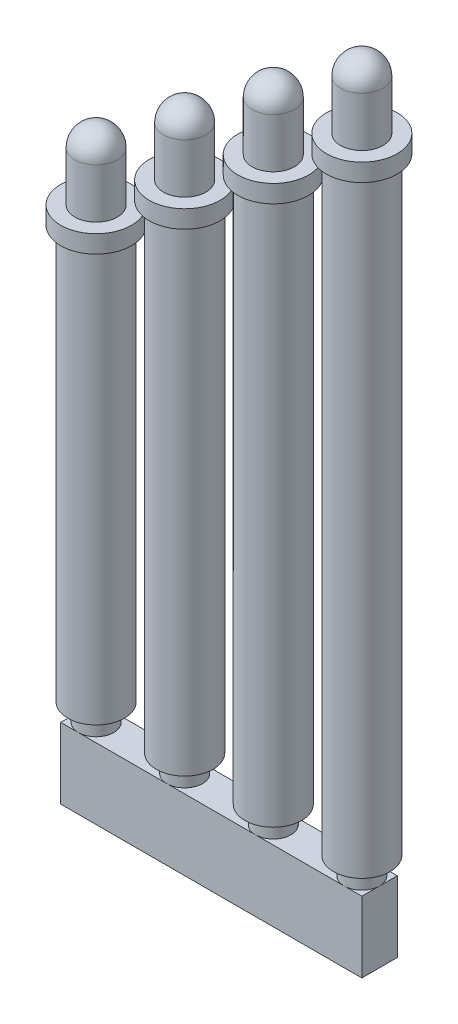
ISO-10303-21;
HEADER;
FILE_DESCRIPTION(('STEP AP214'),'2;1');
FILE_NAME('part.step','',(''),(''),'','','');
FILE_SCHEMA(('AUTOMOTIVE_DESIGN { 1 0 10303 214 1 1 1 1 }'));
ENDSEC;
DATA;
#1=APPLICATION_CONTEXT('core data for automotive mechanical design processes');
#2=APPLICATION_PROTOCOL_DEFINITION('international standard','automotive_design',2000,#1);
#3=PRODUCT_CONTEXT('',#1,'mechanical');
#4=PRODUCT('Part','Part','',(#3));
#5=PRODUCT_RELATED_PRODUCT_CATEGORY('part','',(#4));
#6=PRODUCT_DEFINITION_FORMATION('','',#4);
#7=PRODUCT_DEFINITION_CONTEXT('part definition',#1,'design');
#8=PRODUCT_DEFINITION('design','',#6,#7);
#9=PRODUCT_DEFINITION_SHAPE('','',#8);
#10=(LENGTH_UNIT() NAMED_UNIT(*) SI_UNIT(.MILLI.,.METRE.));
#11=(NAMED_UNIT(*) PLANE_ANGLE_UNIT() SI_UNIT($,.RADIAN.));
#12=(NAMED_UNIT(*) SI_UNIT($,.STERADIAN.) SOLID_ANGLE_UNIT());
#13=UNCERTAINTY_MEASURE_WITH_UNIT(LENGTH_MEASURE(1.E-05),#10,'distance_accuracy_value','');
#14=(GEOMETRIC_REPRESENTATION_CONTEXT(3) GLOBAL_UNCERTAINTY_ASSIGNED_CONTEXT((#13)) GLOBAL_UNIT_ASSIGNED_CONTEXT((#10,
#11,#12)) REPRESENTATION_CONTEXT('',''));
#15=CARTESIAN_POINT('',(0.,0.,0.));
#16=DIRECTION('',(0.,0.,1.));
#17=DIRECTION('',(1.,0.,0.));
#18=AXIS2_PLACEMENT_3D('',#15,#16,#17);
#19=CARTESIAN_POINT('',(0.,0.,0.));
#20=DIRECTION('',(0.,-1.,0.));
#21=DIRECTION('',(0.,0.,-1.));
#22=AXIS2_PLACEMENT_3D('',#19,#20,#21);
#23=PLANE('',#22);
#24=DIRECTION('',(1.,0.,0.));
#25=VECTOR('',#24,1.);
#26=CARTESIAN_POINT('',(-0.499999999999999,0.,-0.499999999999999));
#27=LINE('',#26,#25);
#28=CARTESIAN_POINT('',(7.5,0.,-0.499999999999999));
#29=VERTEX_POINT('',#28);
#30=CARTESIAN_POINT('',(8.,0.,-0.499999999999999));
#31=VERTEX_POINT('',#30);
#32=EDGE_CURVE('E154',#29,#31,#27,.T.);
#33=ORIENTED_EDGE('',*,*,#32,.F.);
#34=CARTESIAN_POINT('',(7.5,0.,0.));
#35=DIRECTION('',(0.,1.,0.));
#36=DIRECTION('',(-1.,0.,0.));
#37=AXIS2_PLACEMENT_3D('',#34,#35,#36);
#38=CIRCLE('',#37,0.5);
#39=CARTESIAN_POINT('',(8.,0.,0.));
#40=VERTEX_POINT('',#39);
#41=EDGE_CURVE('E49',#40,#29,#38,.T.);
#42=ORIENTED_EDGE('',*,*,#41,.F.);
#43=DIRECTION('',(0.,0.,1.));
#44=VECTOR('',#43,1.);
#45=CARTESIAN_POINT('',(8.,0.,0.499999999999999));
#46=LINE('',#45,#44);
#47=EDGE_CURVE('E142',#31,#40,#46,.T.);
#48=ORIENTED_EDGE('',*,*,#47,.F.);
#49=EDGE_LOOP('',(#33,#42,#48));
#50=FACE_BOUND('',#49,.T.);
#51=ADVANCED_FACE('F34',(#50),#23,.F.);
#52=CARTESIAN_POINT('',(8.,0.,0.499999999999999));
#53=VERTEX_POINT('',#52);
#54=EDGE_CURVE('E120',#40,#53,#46,.T.);
#55=ORIENTED_EDGE('',*,*,#54,.F.);
#56=CARTESIAN_POINT('',(7.5,0.,0.499999999999999));
#57=VERTEX_POINT('',#56);
#58=EDGE_CURVE('E107',#57,#40,#38,.T.);
#59=ORIENTED_EDGE('',*,*,#58,.F.);
#60=DIRECTION('',(-1.,0.,0.));
#61=VECTOR('',#60,1.);
#62=CARTESIAN_POINT('',(-0.499999999999999,0.,0.499999999999999));
#63=LINE('',#62,#61);
#64=EDGE_CURVE('E119',#53,#57,#63,.T.);
#65=ORIENTED_EDGE('',*,*,#64,.F.);
#66=EDGE_LOOP('',(#55,#59,#65));
#67=FACE_BOUND('',#66,.T.);
#68=ADVANCED_FACE('F117',(#67),#23,.F.);
#69=CARTESIAN_POINT('',(5.,0.,0.499999999999999));
#70=VERTEX_POINT('',#69);
#71=EDGE_CURVE('E123',#57,#70,#63,.T.);
#72=ORIENTED_EDGE('',*,*,#71,.F.);
#73=EDGE_CURVE('E103',#29,#57,#38,.T.);
#74=ORIENTED_EDGE('',*,*,#73,.F.);
#75=CARTESIAN_POINT('',(5.,0.,-0.499999999999999));
#76=VERTEX_POINT('',#75);
#77=EDGE_CURVE('E299',#76,#29,#27,.T.);
#78=ORIENTED_EDGE('',*,*,#77,.F.);
#79=CARTESIAN_POINT('',(5.,0.,0.));
#80=DIRECTION('',(0.,1.,0.));
#81=DIRECTION('',(-1.,0.,0.));
#82=AXIS2_PLACEMENT_3D('',#79,#80,#81);
#83=CIRCLE('',#82,0.5);
#84=EDGE_CURVE('E56',#70,#76,#83,.T.);
#85=ORIENTED_EDGE('',*,*,#84,.F.);
#86=EDGE_LOOP('',(#72,#74,#78,#85));
#87=FACE_BOUND('',#86,.T.);
#88=ADVANCED_FACE('F124',(#87),#23,.F.);
#89=CARTESIAN_POINT('',(2.5,0.,0.499999999999999));
#90=VERTEX_POINT('',#89);
#91=EDGE_CURVE('E127',#70,#90,#63,.T.);
#92=ORIENTED_EDGE('',*,*,#91,.F.);
#93=EDGE_CURVE('E192',#76,#70,#83,.T.);
#94=ORIENTED_EDGE('',*,*,#93,.F.);
#95=CARTESIAN_POINT('',(2.5,0.,-0.499999999999999));
#96=VERTEX_POINT('',#95);
#97=EDGE_CURVE('E295',#96,#76,#27,.T.);
#98=ORIENTED_EDGE('',*,*,#97,.F.);
#99=CARTESIAN_POINT('',(2.5,0.,0.));
#100=DIRECTION('',(0.,1.,0.));
#101=DIRECTION('',(-1.,0.,0.));
#102=AXIS2_PLACEMENT_3D('',#99,#100,#101);
#103=CIRCLE('',#102,0.5);
#104=EDGE_CURVE('E167',#90,#96,#103,.T.);
#105=ORIENTED_EDGE('',*,*,#104,.F.);
#106=EDGE_LOOP('',(#92,#94,#98,#105));
#107=FACE_BOUND('',#106,.T.);
#108=ADVANCED_FACE('F282',(#107),#23,.F.);
#109=CARTESIAN_POINT('',(0.,14.65,0.));
#110=DIRECTION('',(0.,1.,0.));
#111=DIRECTION('',(-1.,0.,0.));
#112=AXIS2_PLACEMENT_3D('',#109,#110,#111);
#113=CYLINDRICAL_SURFACE('',#112,0.499999999999999);
#114=CARTESIAN_POINT('',(0.,0.,0.));
#115=DIRECTION('',(0.,1.,0.));
#116=DIRECTION('',(-1.,0.,0.));
#117=AXIS2_PLACEMENT_3D('',#114,#115,#116);
#118=CIRCLE('',#117,0.499999999999999);
#119=CARTESIAN_POINT('',(-0.499999999999999,0.,0.));
#120=VERTEX_POINT('',#119);
#121=CARTESIAN_POINT('',(0.,0.,0.499999999999999));
#122=VERTEX_POINT('',#121);
#123=EDGE_CURVE('E42',#120,#122,#118,.T.);
#124=ORIENTED_EDGE('',*,*,#123,.T.);
#125=CARTESIAN_POINT('',(0.,0.,-0.499999999999999));
#126=VERTEX_POINT('',#125);
#127=EDGE_CURVE('E290',#122,#126,#118,.T.);
#128=ORIENTED_EDGE('',*,*,#127,.T.);
#129=EDGE_CURVE('E310',#126,#120,#118,.T.);
#130=ORIENTED_EDGE('',*,*,#129,.T.);
#131=EDGE_LOOP('',(#124,#128,#130));
#132=FACE_BOUND('',#131,.T.);
#133=CARTESIAN_POINT('',(0.,0.5,0.));
#134=DIRECTION('',(0.,1.,0.));
#135=DIRECTION('',(-1.,0.,0.));
#136=AXIS2_PLACEMENT_3D('',#133,#134,#135);
#137=CIRCLE('',#136,0.499999999999999);
#138=CARTESIAN_POINT('',(-0.499999999999999,0.5,0.));
#139=VERTEX_POINT('',#138);
#140=EDGE_CURVE('E312',#139,#139,#137,.T.);
#141=ORIENTED_EDGE('',*,*,#140,.F.);
#142=EDGE_LOOP('',(#141));
#143=FACE_BOUND('',#142,.T.);
#144=ADVANCED_FACE('F308',(#132,#143),#113,.T.);
#145=CARTESIAN_POINT('',(-0.499999999999999,0.5,0.));
#146=DIRECTION('',(0.,-1.,0.));
#147=DIRECTION('',(1.,0.,0.));
#148=AXIS2_PLACEMENT_3D('',#145,#146,#147);
#149=PLANE('',#148);
#150=ORIENTED_EDGE('',*,*,#140,.T.);
#151=EDGE_LOOP('',(#150));
#152=FACE_BOUND('',#151,.T.);
#153=CARTESIAN_POINT('',(0.,0.5,0.));
#154=DIRECTION('',(0.,1.,0.));
#155=DIRECTION('',(-1.,0.,0.));
#156=AXIS2_PLACEMENT_3D('',#153,#154,#155);
#157=CIRCLE('',#156,0.799999999999999);
#158=CARTESIAN_POINT('',(-0.799999999999999,0.5,0.));
#159=VERTEX_POINT('',#158);
#160=EDGE_CURVE('E316',#159,#159,#157,.T.);
#161=ORIENTED_EDGE('',*,*,#160,.F.);
#162=EDGE_LOOP('',(#161));
#163=FACE_BOUND('',#162,.T.);
#164=ADVANCED_FACE('F366',(#152,#163),#149,.T.);
#165=CARTESIAN_POINT('',(0.,14.65,0.));
#166=DIRECTION('',(0.,1.,0.));
#167=DIRECTION('',(-1.,0.,0.));
#168=AXIS2_PLACEMENT_3D('',#165,#166,#167);
#169=CYLINDRICAL_SURFACE('',#168,0.799999999999999);
#170=ORIENTED_EDGE('',*,*,#160,.T.);
#171=EDGE_LOOP('',(#170));
#172=FACE_BOUND('',#171,.T.);
#173=CARTESIAN_POINT('',(0.,12.15,0.));
#174=DIRECTION('',(0.,1.,0.));
#175=DIRECTION('',(-1.,0.,0.));
#176=AXIS2_PLACEMENT_3D('',#173,#174,#175);
#177=CIRCLE('',#176,0.8);
#178=CARTESIAN_POINT('',(-0.8,12.15,0.));
#179=VERTEX_POINT('',#178);
#180=EDGE_CURVE('E319',#179,#179,#177,.T.);
#181=ORIENTED_EDGE('',*,*,#180,.F.);
#182=EDGE_LOOP('',(#181));
#183=FACE_BOUND('',#182,.T.);
#184=ADVANCED_FACE('F362',(#172,#183),#169,.T.);
#185=CARTESIAN_POINT('',(-1.,12.15,0.));
#186=DIRECTION('',(0.,-1.,0.));
#187=DIRECTION('',(1.,0.,0.));
#188=AXIS2_PLACEMENT_3D('',#185,#186,#187);
#189=PLANE('',#188);
#190=ORIENTED_EDGE('',*,*,#180,.T.);
#191=EDGE_LOOP('',(#190));
#192=FACE_BOUND('',#191,.T.);
#193=CARTESIAN_POINT('',(0.,12.15,0.));
#194=DIRECTION('',(0.,1.,0.));
#195=DIRECTION('',(-1.,0.,0.));
#196=AXIS2_PLACEMENT_3D('',#193,#194,#195);
#197=CIRCLE('',#196,0.999999999999999);
#198=CARTESIAN_POINT('',(-1.,12.15,0.));
#199=VERTEX_POINT('',#198);
#200=EDGE_CURVE('E322',#199,#199,#197,.T.);
#201=ORIENTED_EDGE('',*,*,#200,.F.);
#202=EDGE_LOOP('',(#201));
#203=FACE_BOUND('',#202,.T.);
#204=ADVANCED_FACE('F358',(#192,#203),#189,.T.);
#205=CARTESIAN_POINT('',(0.,14.65,0.));
#206=DIRECTION('',(0.,1.,0.));
#207=DIRECTION('',(-1.,0.,0.));
#208=AXIS2_PLACEMENT_3D('',#205,#206,#207);
#209=CYLINDRICAL_SURFACE('',#208,0.999999999999999);
#210=ORIENTED_EDGE('',*,*,#200,.T.);
#211=EDGE_LOOP('',(#210));
#212=FACE_BOUND('',#211,.T.);
#213=CARTESIAN_POINT('',(0.,12.65,0.));
#214=DIRECTION('',(0.,1.,0.));
#215=DIRECTION('',(-1.,0.,0.));
#216=AXIS2_PLACEMENT_3D('',#213,#214,#215);
#217=CIRCLE('',#216,0.999999999999999);
#218=CARTESIAN_POINT('',(-1.,12.65,0.));
#219=VERTEX_POINT('',#218);
#220=EDGE_CURVE('E325',#219,#219,#217,.T.);
#221=ORIENTED_EDGE('',*,*,#220,.F.);
#222=EDGE_LOOP('',(#221));
#223=FACE_BOUND('',#222,.T.);
#224=ADVANCED_FACE('F354',(#212,#223),#209,.T.);
#225=CARTESIAN_POINT('',(-1.,12.65,0.));
#226=DIRECTION('',(0.,1.,0.));
#227=DIRECTION('',(-1.,0.,0.));
#228=AXIS2_PLACEMENT_3D('',#225,#226,#227);
#229=PLANE('',#228);
#230=ORIENTED_EDGE('',*,*,#220,.T.);
#231=EDGE_LOOP('',(#230));
#232=FACE_BOUND('',#231,.T.);
#233=CARTESIAN_POINT('',(0.,12.65,0.));
#234=DIRECTION('',(0.,1.,0.));
#235=DIRECTION('',(-1.,0.,0.));
#236=AXIS2_PLACEMENT_3D('',#233,#234,#235);
#237=CIRCLE('',#236,0.599999999999999);
#238=CARTESIAN_POINT('',(-0.6,12.65,0.));
#239=VERTEX_POINT('',#238);
#240=EDGE_CURVE('E328',#239,#239,#237,.T.);
#241=ORIENTED_EDGE('',*,*,#240,.F.);
#242=EDGE_LOOP('',(#241));
#243=FACE_BOUND('',#242,.T.);
#244=ADVANCED_FACE('F350',(#232,#243),#229,.T.);
#245=CARTESIAN_POINT('',(0.,14.65,0.));
#246=DIRECTION('',(0.,1.,0.));
#247=DIRECTION('',(-1.,0.,0.));
#248=AXIS2_PLACEMENT_3D('',#245,#246,#247);
#249=CYLINDRICAL_SURFACE('',#248,0.599999999999999);
#250=CARTESIAN_POINT('',(0.,14.05,0.));
#251=DIRECTION('',(0.,1.,0.));
#252=DIRECTION('',(-1.,0.,0.));
#253=AXIS2_PLACEMENT_3D('',#250,#251,#252);
#254=CIRCLE('',#253,0.599999999999999);
#255=CARTESIAN_POINT('',(-0.6,14.05,0.));
#256=VERTEX_POINT('',#255);
#257=EDGE_CURVE('E11',#256,#256,#254,.F.);
#258=ORIENTED_EDGE('',*,*,#257,.T.);
#259=EDGE_LOOP('',(#258));
#260=FACE_BOUND('',#259,.T.);
#261=ORIENTED_EDGE('',*,*,#240,.T.);
#262=EDGE_LOOP('',(#261));
#263=FACE_BOUND('',#262,.T.);
#264=ADVANCED_FACE('F347',(#260,#263),#249,.T.);
#265=CARTESIAN_POINT('',(0.,14.05,0.));
#266=DIRECTION('',(0.,1.,0.));
#267=DIRECTION('',(-1.,0.,0.));
#268=AXIS2_PLACEMENT_3D('',#265,#266,#267);
#269=SPHERICAL_SURFACE('',#268,0.6);
#270=ORIENTED_EDGE('',*,*,#257,.F.);
#271=EDGE_LOOP('',(#270));
#272=FACE_BOUND('',#271,.T.);
#273=ADVANCED_FACE('F36',(#272),#269,.T.);
#274=ORIENTED_EDGE('',*,*,#123,.F.);
#275=DIRECTION('',(0.,0.,-1.));
#276=VECTOR('',#275,1.);
#277=CARTESIAN_POINT('',(-0.499999999999999,0.,0.499999999999999));
#278=LINE('',#277,#276);
#279=CARTESIAN_POINT('',(-0.499999999999999,0.,0.499999999999999));
#280=VERTEX_POINT('',#279);
#281=EDGE_CURVE('E155',#280,#120,#278,.T.);
#282=ORIENTED_EDGE('',*,*,#281,.F.);
#283=EDGE_CURVE('E135',#122,#280,#63,.T.);
#284=ORIENTED_EDGE('',*,*,#283,.F.);
#285=EDGE_LOOP('',(#274,#282,#284));
#286=FACE_BOUND('',#285,.T.);
#287=ADVANCED_FACE('F272',(#286),#23,.F.);
#288=EDGE_CURVE('E141',#90,#122,#63,.T.);
#289=ORIENTED_EDGE('',*,*,#288,.F.);
#290=EDGE_CURVE('E169',#96,#90,#103,.T.);
#291=ORIENTED_EDGE('',*,*,#290,.F.);
#292=EDGE_CURVE('E153',#126,#96,#27,.T.);
#293=ORIENTED_EDGE('',*,*,#292,.F.);
#294=ORIENTED_EDGE('',*,*,#127,.F.);
#295=EDGE_LOOP('',(#289,#291,#293,#294));
#296=FACE_BOUND('',#295,.T.);
#297=ADVANCED_FACE('F261',(#296),#23,.F.);
#298=CARTESIAN_POINT('',(-0.499999999999999,-2.,0.499999999999999));
#299=DIRECTION('',(1.,0.,0.));
#300=DIRECTION('',(0.,0.,-1.));
#301=AXIS2_PLACEMENT_3D('',#298,#299,#300);
#302=PLANE('',#301);
#303=ORIENTED_EDGE('',*,*,#281,.T.);
#304=CARTESIAN_POINT('',(-0.499999999999999,0.,-0.499999999999999));
#305=VERTEX_POINT('',#304);
#306=EDGE_CURVE('E157',#120,#305,#278,.T.);
#307=ORIENTED_EDGE('',*,*,#306,.T.);
#308=DIRECTION('',(0.,1.,0.));
#309=VECTOR('',#308,1.);
#310=CARTESIAN_POINT('',(-0.499999999999999,-2.,-0.499999999999999));
#311=LINE('',#310,#309);
#312=CARTESIAN_POINT('',(-0.499999999999999,-2.,-0.499999999999999));
#313=VERTEX_POINT('',#312);
#314=EDGE_CURVE('E303',#313,#305,#311,.T.);
#315=ORIENTED_EDGE('',*,*,#314,.F.);
#316=DIRECTION('',(0.,0.,-1.));
#317=VECTOR('',#316,1.);
#318=CARTESIAN_POINT('',(-0.499999999999999,-2.,0.499999999999999));
#319=LINE('',#318,#317);
#320=CARTESIAN_POINT('',(-0.499999999999999,-2.,0.499999999999999));
#321=VERTEX_POINT('',#320);
#322=EDGE_CURVE('E134',#321,#313,#319,.T.);
#323=ORIENTED_EDGE('',*,*,#322,.F.);
#324=DIRECTION('',(0.,1.,0.));
#325=VECTOR('',#324,1.);
#326=CARTESIAN_POINT('',(-0.499999999999999,-2.,0.499999999999999));
#327=LINE('',#326,#325);
#328=EDGE_CURVE('E160',#321,#280,#327,.T.);
#329=ORIENTED_EDGE('',*,*,#328,.T.);
#330=EDGE_LOOP('',(#303,#307,#315,#323,#329));
#331=FACE_BOUND('',#330,.T.);
#332=ADVANCED_FACE('F271',(#331),#302,.F.);
#333=CARTESIAN_POINT('',(-0.499999999999999,-2.,-0.499999999999999));
#334=DIRECTION('',(0.,0.,1.));
#335=DIRECTION('',(1.,0.,0.));
#336=AXIS2_PLACEMENT_3D('',#333,#334,#335);
#337=PLANE('',#336);
#338=EDGE_CURVE('E149',#305,#126,#27,.T.);
#339=ORIENTED_EDGE('',*,*,#338,.T.);
#340=ORIENTED_EDGE('',*,*,#292,.T.);
#341=ORIENTED_EDGE('',*,*,#97,.T.);
#342=ORIENTED_EDGE('',*,*,#77,.T.);
#343=ORIENTED_EDGE('',*,*,#32,.T.);
#344=DIRECTION('',(0.,1.,0.));
#345=VECTOR('',#344,1.);
#346=CARTESIAN_POINT('',(8.,-2.,-0.499999999999999));
#347=LINE('',#346,#345);
#348=CARTESIAN_POINT('',(8.,-2.,-0.499999999999999));
#349=VERTEX_POINT('',#348);
#350=EDGE_CURVE('E332',#349,#31,#347,.T.);
#351=ORIENTED_EDGE('',*,*,#350,.F.);
#352=DIRECTION('',(1.,0.,0.));
#353=VECTOR('',#352,1.);
#354=CARTESIAN_POINT('',(-0.499999999999999,-2.,-0.499999999999999));
#355=LINE('',#354,#353);
#356=EDGE_CURVE('E137',#313,#349,#355,.T.);
#357=ORIENTED_EDGE('',*,*,#356,.F.);
#358=ORIENTED_EDGE('',*,*,#314,.T.);
#359=EDGE_LOOP('',(#339,#340,#341,#342,#343,#351,#357,#358));
#360=FACE_BOUND('',#359,.T.);
#361=ADVANCED_FACE('F278',(#360),#337,.F.);
#362=CARTESIAN_POINT('',(8.,-2.,0.499999999999999));
#363=DIRECTION('',(-1.,0.,0.));
#364=DIRECTION('',(0.,0.,1.));
#365=AXIS2_PLACEMENT_3D('',#362,#363,#364);
#366=PLANE('',#365);
#367=ORIENTED_EDGE('',*,*,#47,.T.);
#368=ORIENTED_EDGE('',*,*,#54,.T.);
#369=DIRECTION('',(0.,1.,0.));
#370=VECTOR('',#369,1.);
#371=CARTESIAN_POINT('',(8.,-2.,0.499999999999999));
#372=LINE('',#371,#370);
#373=CARTESIAN_POINT('',(8.,-2.,0.499999999999999));
#374=VERTEX_POINT('',#373);
#375=EDGE_CURVE('E133',#374,#53,#372,.T.);
#376=ORIENTED_EDGE('',*,*,#375,.F.);
#377=DIRECTION('',(0.,0.,1.));
#378=VECTOR('',#377,1.);
#379=CARTESIAN_POINT('',(8.,-2.,0.499999999999999));
#380=LINE('',#379,#378);
#381=EDGE_CURVE('E161',#349,#374,#380,.T.);
#382=ORIENTED_EDGE('',*,*,#381,.F.);
#383=ORIENTED_EDGE('',*,*,#350,.T.);
#384=EDGE_LOOP('',(#367,#368,#376,#382,#383));
#385=FACE_BOUND('',#384,.T.);
#386=ADVANCED_FACE('F338',(#385),#366,.F.);
#387=CARTESIAN_POINT('',(-0.499999999999999,-2.,0.499999999999999));
#388=DIRECTION('',(0.,0.,-1.));
#389=DIRECTION('',(-1.,0.,0.));
#390=AXIS2_PLACEMENT_3D('',#387,#388,#389);
#391=PLANE('',#390);
#392=ORIENTED_EDGE('',*,*,#64,.T.);
#393=ORIENTED_EDGE('',*,*,#71,.T.);
#394=ORIENTED_EDGE('',*,*,#91,.T.);
#395=ORIENTED_EDGE('',*,*,#288,.T.);
#396=ORIENTED_EDGE('',*,*,#283,.T.);
#397=ORIENTED_EDGE('',*,*,#328,.F.);
#398=DIRECTION('',(-1.,0.,0.));
#399=VECTOR('',#398,1.);
#400=CARTESIAN_POINT('',(-0.499999999999999,-2.,0.499999999999999));
#401=LINE('',#400,#399);
#402=EDGE_CURVE('E158',#374,#321,#401,.T.);
#403=ORIENTED_EDGE('',*,*,#402,.F.);
#404=ORIENTED_EDGE('',*,*,#375,.T.);
#405=EDGE_LOOP('',(#392,#393,#394,#395,#396,#397,#403,#404));
#406=FACE_BOUND('',#405,.T.);
#407=ADVANCED_FACE('F130',(#406),#391,.F.);
#408=CARTESIAN_POINT('',(0.,-2.,0.));
#409=DIRECTION('',(0.,-1.,0.));
#410=DIRECTION('',(0.,0.,-1.));
#411=AXIS2_PLACEMENT_3D('',#408,#409,#410);
#412=PLANE('',#411);
#413=ORIENTED_EDGE('',*,*,#322,.T.);
#414=ORIENTED_EDGE('',*,*,#356,.T.);
#415=ORIENTED_EDGE('',*,*,#381,.T.);
#416=ORIENTED_EDGE('',*,*,#402,.T.);
#417=EDGE_LOOP('',(#413,#414,#415,#416));
#418=FACE_BOUND('',#417,.T.);
#419=ADVANCED_FACE('F259',(#418),#412,.T.);
#420=ORIENTED_EDGE('',*,*,#129,.F.);
#421=ORIENTED_EDGE('',*,*,#338,.F.);
#422=ORIENTED_EDGE('',*,*,#306,.F.);
#423=EDGE_LOOP('',(#420,#421,#422));
#424=FACE_BOUND('',#423,.T.);
#425=ADVANCED_FACE('F251',(#424),#23,.F.);
#426=CARTESIAN_POINT('',(2.5,16.51,0.));
#427=DIRECTION('',(0.,1.,0.));
#428=DIRECTION('',(-1.,0.,0.));
#429=AXIS2_PLACEMENT_3D('',#426,#427,#428);
#430=CYLINDRICAL_SURFACE('',#429,0.5);
#431=ORIENTED_EDGE('',*,*,#104,.T.);
#432=ORIENTED_EDGE('',*,*,#290,.T.);
#433=EDGE_LOOP('',(#431,#432));
#434=FACE_BOUND('',#433,.T.);
#435=CARTESIAN_POINT('',(2.5,0.5,0.));
#436=DIRECTION('',(0.,1.,0.));
#437=DIRECTION('',(-1.,0.,0.));
#438=AXIS2_PLACEMENT_3D('',#435,#436,#437);
#439=CIRCLE('',#438,0.5);
#440=CARTESIAN_POINT('',(2.,0.5,0.));
#441=VERTEX_POINT('',#440);
#442=EDGE_CURVE('E170',#441,#441,#439,.T.);
#443=ORIENTED_EDGE('',*,*,#442,.F.);
#444=EDGE_LOOP('',(#443));
#445=FACE_BOUND('',#444,.T.);
#446=ADVANCED_FACE('F258',(#434,#445),#430,.T.);
#447=CARTESIAN_POINT('',(2.,0.5,0.));
#448=DIRECTION('',(0.,-1.,0.));
#449=DIRECTION('',(1.,0.,0.));
#450=AXIS2_PLACEMENT_3D('',#447,#448,#449);
#451=PLANE('',#450);
#452=ORIENTED_EDGE('',*,*,#442,.T.);
#453=EDGE_LOOP('',(#452));
#454=FACE_BOUND('',#453,.T.);
#455=CARTESIAN_POINT('',(2.5,0.5,0.));
#456=DIRECTION('',(0.,1.,0.));
#457=DIRECTION('',(-1.,0.,0.));
#458=AXIS2_PLACEMENT_3D('',#455,#456,#457);
#459=CIRCLE('',#458,0.8);
#460=CARTESIAN_POINT('',(1.7,0.5,0.));
#461=VERTEX_POINT('',#460);
#462=EDGE_CURVE('E173',#461,#461,#459,.T.);
#463=ORIENTED_EDGE('',*,*,#462,.F.);
#464=EDGE_LOOP('',(#463));
#465=FACE_BOUND('',#464,.T.);
#466=ADVANCED_FACE('F266',(#454,#465),#451,.T.);
#467=CARTESIAN_POINT('',(2.5,16.51,0.));
#468=DIRECTION('',(0.,1.,0.));
#469=DIRECTION('',(-1.,0.,0.));
#470=AXIS2_PLACEMENT_3D('',#467,#468,#469);
#471=CYLINDRICAL_SURFACE('',#470,0.8);
#472=ORIENTED_EDGE('',*,*,#462,.T.);
#473=EDGE_LOOP('',(#472));
#474=FACE_BOUND('',#473,.T.);
#475=CARTESIAN_POINT('',(2.5,14.01,0.));
#476=DIRECTION('',(0.,1.,0.));
#477=DIRECTION('',(-1.,0.,0.));
#478=AXIS2_PLACEMENT_3D('',#475,#476,#477);
#479=CIRCLE('',#478,0.8);
#480=CARTESIAN_POINT('',(1.7,14.01,0.));
#481=VERTEX_POINT('',#480);
#482=EDGE_CURVE('E176',#481,#481,#479,.T.);
#483=ORIENTED_EDGE('',*,*,#482,.F.);
#484=EDGE_LOOP('',(#483));
#485=FACE_BOUND('',#484,.T.);
#486=ADVANCED_FACE('F495',(#474,#485),#471,.T.);
#487=CARTESIAN_POINT('',(1.5,14.01,0.));
#488=DIRECTION('',(0.,-1.,0.));
#489=DIRECTION('',(1.,0.,0.));
#490=AXIS2_PLACEMENT_3D('',#487,#488,#489);
#491=PLANE('',#490);
#492=ORIENTED_EDGE('',*,*,#482,.T.);
#493=EDGE_LOOP('',(#492));
#494=FACE_BOUND('',#493,.T.);
#495=CARTESIAN_POINT('',(2.5,14.01,0.));
#496=DIRECTION('',(0.,1.,0.));
#497=DIRECTION('',(-1.,0.,0.));
#498=AXIS2_PLACEMENT_3D('',#495,#496,#497);
#499=CIRCLE('',#498,1.);
#500=CARTESIAN_POINT('',(1.5,14.01,0.));
#501=VERTEX_POINT('',#500);
#502=EDGE_CURVE('E179',#501,#501,#499,.T.);
#503=ORIENTED_EDGE('',*,*,#502,.F.);
#504=EDGE_LOOP('',(#503));
#505=FACE_BOUND('',#504,.T.);
#506=ADVANCED_FACE('F505',(#494,#505),#491,.T.);
#507=CARTESIAN_POINT('',(2.5,16.51,0.));
#508=DIRECTION('',(0.,1.,0.));
#509=DIRECTION('',(-1.,0.,0.));
#510=AXIS2_PLACEMENT_3D('',#507,#508,#509);
#511=CYLINDRICAL_SURFACE('',#510,1.);
#512=ORIENTED_EDGE('',*,*,#502,.T.);
#513=EDGE_LOOP('',(#512));
#514=FACE_BOUND('',#513,.T.);
#515=CARTESIAN_POINT('',(2.5,14.51,0.));
#516=DIRECTION('',(0.,1.,0.));
#517=DIRECTION('',(-1.,0.,0.));
#518=AXIS2_PLACEMENT_3D('',#515,#516,#517);
#519=CIRCLE('',#518,1.);
#520=CARTESIAN_POINT('',(1.5,14.51,0.));
#521=VERTEX_POINT('',#520);
#522=EDGE_CURVE('E182',#521,#521,#519,.T.);
#523=ORIENTED_EDGE('',*,*,#522,.F.);
#524=EDGE_LOOP('',(#523));
#525=FACE_BOUND('',#524,.T.);
#526=ADVANCED_FACE('F515',(#514,#525),#511,.T.);
#527=CARTESIAN_POINT('',(1.5,14.51,0.));
#528=DIRECTION('',(0.,1.,0.));
#529=DIRECTION('',(-1.,0.,0.));
#530=AXIS2_PLACEMENT_3D('',#527,#528,#529);
#531=PLANE('',#530);
#532=ORIENTED_EDGE('',*,*,#522,.T.);
#533=EDGE_LOOP('',(#532));
#534=FACE_BOUND('',#533,.T.);
#535=CARTESIAN_POINT('',(2.5,14.51,0.));
#536=DIRECTION('',(0.,1.,0.));
#537=DIRECTION('',(-1.,0.,0.));
#538=AXIS2_PLACEMENT_3D('',#535,#536,#537);
#539=CIRCLE('',#538,0.599999999999999);
#540=CARTESIAN_POINT('',(1.9,14.51,0.));
#541=VERTEX_POINT('',#540);
#542=EDGE_CURVE('E185',#541,#541,#539,.T.);
#543=ORIENTED_EDGE('',*,*,#542,.F.);
#544=EDGE_LOOP('',(#543));
#545=FACE_BOUND('',#544,.T.);
#546=ADVANCED_FACE('F525',(#534,#545),#531,.T.);
#547=CARTESIAN_POINT('',(2.5,16.51,0.));
#548=DIRECTION('',(0.,1.,0.));
#549=DIRECTION('',(-1.,0.,0.));
#550=AXIS2_PLACEMENT_3D('',#547,#548,#549);
#551=CYLINDRICAL_SURFACE('',#550,0.599999999999999);
#552=CARTESIAN_POINT('',(2.5,15.91,0.));
#553=DIRECTION('',(0.,1.,0.));
#554=DIRECTION('',(-1.,0.,0.));
#555=AXIS2_PLACEMENT_3D('',#552,#553,#554);
#556=CIRCLE('',#555,0.599999999999999);
#557=CARTESIAN_POINT('',(1.9,15.91,0.));
#558=VERTEX_POINT('',#557);
#559=EDGE_CURVE('E164',#558,#558,#556,.F.);
#560=ORIENTED_EDGE('',*,*,#559,.T.);
#561=EDGE_LOOP('',(#560));
#562=FACE_BOUND('',#561,.T.);
#563=ORIENTED_EDGE('',*,*,#542,.T.);
#564=EDGE_LOOP('',(#563));
#565=FACE_BOUND('',#564,.T.);
#566=ADVANCED_FACE('F535',(#562,#565),#551,.T.);
#567=CARTESIAN_POINT('',(2.5,15.91,0.));
#568=DIRECTION('',(0.,1.,0.));
#569=DIRECTION('',(-1.,0.,0.));
#570=AXIS2_PLACEMENT_3D('',#567,#568,#569);
#571=SPHERICAL_SURFACE('',#570,0.6);
#572=ORIENTED_EDGE('',*,*,#559,.F.);
#573=EDGE_LOOP('',(#572));
#574=FACE_BOUND('',#573,.T.);
#575=ADVANCED_FACE('F545',(#574),#571,.T.);
#576=CARTESIAN_POINT('',(5.,18.38,0.));
#577=DIRECTION('',(0.,1.,0.));
#578=DIRECTION('',(-1.,0.,0.));
#579=AXIS2_PLACEMENT_3D('',#576,#577,#578);
#580=CYLINDRICAL_SURFACE('',#579,0.5);
#581=ORIENTED_EDGE('',*,*,#84,.T.);
#582=ORIENTED_EDGE('',*,*,#93,.T.);
#583=EDGE_LOOP('',(#581,#582));
#584=FACE_BOUND('',#583,.T.);
#585=CARTESIAN_POINT('',(5.,0.5,0.));
#586=DIRECTION('',(0.,1.,0.));
#587=DIRECTION('',(-1.,0.,0.));
#588=AXIS2_PLACEMENT_3D('',#585,#586,#587);
#589=CIRCLE('',#588,0.5);
#590=CARTESIAN_POINT('',(4.5,0.5,0.));
#591=VERTEX_POINT('',#590);
#592=EDGE_CURVE('E193',#591,#591,#589,.T.);
#593=ORIENTED_EDGE('',*,*,#592,.F.);
#594=EDGE_LOOP('',(#593));
#595=FACE_BOUND('',#594,.T.);
#596=ADVANCED_FACE('F555',(#584,#595),#580,.T.);
#597=CARTESIAN_POINT('',(4.5,0.5,0.));
#598=DIRECTION('',(0.,-1.,0.));
#599=DIRECTION('',(1.,0.,0.));
#600=AXIS2_PLACEMENT_3D('',#597,#598,#599);
#601=PLANE('',#600);
#602=ORIENTED_EDGE('',*,*,#592,.T.);
#603=EDGE_LOOP('',(#602));
#604=FACE_BOUND('',#603,.T.);
#605=CARTESIAN_POINT('',(5.,0.5,0.));
#606=DIRECTION('',(0.,1.,0.));
#607=DIRECTION('',(-1.,0.,0.));
#608=AXIS2_PLACEMENT_3D('',#605,#606,#607);
#609=CIRCLE('',#608,0.8);
#610=CARTESIAN_POINT('',(4.2,0.5,0.));
#611=VERTEX_POINT('',#610);
#612=EDGE_CURVE('E196',#611,#611,#609,.T.);
#613=ORIENTED_EDGE('',*,*,#612,.F.);
#614=EDGE_LOOP('',(#613));
#615=FACE_BOUND('',#614,.T.);
#616=ADVANCED_FACE('F565',(#604,#615),#601,.T.);
#617=CARTESIAN_POINT('',(5.,18.38,0.));
#618=DIRECTION('',(0.,1.,0.));
#619=DIRECTION('',(-1.,0.,0.));
#620=AXIS2_PLACEMENT_3D('',#617,#618,#619);
#621=CYLINDRICAL_SURFACE('',#620,0.8);
#622=ORIENTED_EDGE('',*,*,#612,.T.);
#623=EDGE_LOOP('',(#622));
#624=FACE_BOUND('',#623,.T.);
#625=CARTESIAN_POINT('',(5.,15.88,0.));
#626=DIRECTION('',(0.,1.,0.));
#627=DIRECTION('',(-1.,0.,0.));
#628=AXIS2_PLACEMENT_3D('',#625,#626,#627);
#629=CIRCLE('',#628,0.800000000000001);
#630=CARTESIAN_POINT('',(4.2,15.88,0.));
#631=VERTEX_POINT('',#630);
#632=EDGE_CURVE('E199',#631,#631,#629,.T.);
#633=ORIENTED_EDGE('',*,*,#632,.F.);
#634=EDGE_LOOP('',(#633));
#635=FACE_BOUND('',#634,.T.);
#636=ADVANCED_FACE('F574',(#624,#635),#621,.T.);
#637=CARTESIAN_POINT('',(4.,15.88,0.));
#638=DIRECTION('',(0.,-1.,0.));
#639=DIRECTION('',(1.,0.,0.));
#640=AXIS2_PLACEMENT_3D('',#637,#638,#639);
#641=PLANE('',#640);
#642=ORIENTED_EDGE('',*,*,#632,.T.);
#643=EDGE_LOOP('',(#642));
#644=FACE_BOUND('',#643,.T.);
#645=CARTESIAN_POINT('',(5.,15.88,0.));
#646=DIRECTION('',(0.,1.,0.));
#647=DIRECTION('',(-1.,0.,0.));
#648=AXIS2_PLACEMENT_3D('',#645,#646,#647);
#649=CIRCLE('',#648,1.);
#650=CARTESIAN_POINT('',(4.,15.88,0.));
#651=VERTEX_POINT('',#650);
#652=EDGE_CURVE('E202',#651,#651,#649,.T.);
#653=ORIENTED_EDGE('',*,*,#652,.F.);
#654=EDGE_LOOP('',(#653));
#655=FACE_BOUND('',#654,.T.);
#656=ADVANCED_FACE('F584',(#644,#655),#641,.T.);
#657=CARTESIAN_POINT('',(5.,18.38,0.));
#658=DIRECTION('',(0.,1.,0.));
#659=DIRECTION('',(-1.,0.,0.));
#660=AXIS2_PLACEMENT_3D('',#657,#658,#659);
#661=CYLINDRICAL_SURFACE('',#660,1.);
#662=ORIENTED_EDGE('',*,*,#652,.T.);
#663=EDGE_LOOP('',(#662));
#664=FACE_BOUND('',#663,.T.);
#665=CARTESIAN_POINT('',(5.,16.38,0.));
#666=DIRECTION('',(0.,1.,0.));
#667=DIRECTION('',(-1.,0.,0.));
#668=AXIS2_PLACEMENT_3D('',#665,#666,#667);
#669=CIRCLE('',#668,1.);
#670=CARTESIAN_POINT('',(4.,16.38,0.));
#671=VERTEX_POINT('',#670);
#672=EDGE_CURVE('E205',#671,#671,#669,.T.);
#673=ORIENTED_EDGE('',*,*,#672,.F.);
#674=EDGE_LOOP('',(#673));
#675=FACE_BOUND('',#674,.T.);
#676=ADVANCED_FACE('F594',(#664,#675),#661,.T.);
#677=CARTESIAN_POINT('',(4.,16.38,0.));
#678=DIRECTION('',(0.,1.,0.));
#679=DIRECTION('',(-1.,0.,0.));
#680=AXIS2_PLACEMENT_3D('',#677,#678,#679);
#681=PLANE('',#680);
#682=ORIENTED_EDGE('',*,*,#672,.T.);
#683=EDGE_LOOP('',(#682));
#684=FACE_BOUND('',#683,.T.);
#685=CARTESIAN_POINT('',(5.,16.38,0.));
#686=DIRECTION('',(0.,1.,0.));
#687=DIRECTION('',(-1.,0.,0.));
#688=AXIS2_PLACEMENT_3D('',#685,#686,#687);
#689=CIRCLE('',#688,0.6);
#690=CARTESIAN_POINT('',(4.4,16.38,0.));
#691=VERTEX_POINT('',#690);
#692=EDGE_CURVE('E208',#691,#691,#689,.T.);
#693=ORIENTED_EDGE('',*,*,#692,.F.);
#694=EDGE_LOOP('',(#693));
#695=FACE_BOUND('',#694,.T.);
#696=ADVANCED_FACE('F604',(#684,#695),#681,.T.);
#697=CARTESIAN_POINT('',(5.,18.38,0.));
#698=DIRECTION('',(0.,1.,0.));
#699=DIRECTION('',(-1.,0.,0.));
#700=AXIS2_PLACEMENT_3D('',#697,#698,#699);
#701=CYLINDRICAL_SURFACE('',#700,0.6);
#702=CARTESIAN_POINT('',(5.,17.78,0.));
#703=DIRECTION('',(0.,1.,0.));
#704=DIRECTION('',(-1.,0.,0.));
#705=AXIS2_PLACEMENT_3D('',#702,#703,#704);
#706=CIRCLE('',#705,0.6);
#707=CARTESIAN_POINT('',(4.4,17.78,0.));
#708=VERTEX_POINT('',#707);
#709=EDGE_CURVE('E188',#708,#708,#706,.F.);
#710=ORIENTED_EDGE('',*,*,#709,.T.);
#711=EDGE_LOOP('',(#710));
#712=FACE_BOUND('',#711,.T.);
#713=ORIENTED_EDGE('',*,*,#692,.T.);
#714=EDGE_LOOP('',(#713));
#715=FACE_BOUND('',#714,.T.);
#716=ADVANCED_FACE('F614',(#712,#715),#701,.T.);
#717=CARTESIAN_POINT('',(5.,17.78,0.));
#718=DIRECTION('',(0.,1.,0.));
#719=DIRECTION('',(-1.,0.,0.));
#720=AXIS2_PLACEMENT_3D('',#717,#718,#719);
#721=SPHERICAL_SURFACE('',#720,0.6);
#722=ORIENTED_EDGE('',*,*,#709,.F.);
#723=EDGE_LOOP('',(#722));
#724=FACE_BOUND('',#723,.T.);
#725=ADVANCED_FACE('F624',(#724),#721,.T.);
#726=CARTESIAN_POINT('',(7.5,20.15,0.));
#727=DIRECTION('',(0.,1.,0.));
#728=DIRECTION('',(-1.,0.,0.));
#729=AXIS2_PLACEMENT_3D('',#726,#727,#728);
#730=CYLINDRICAL_SURFACE('',#729,0.5);
#731=ORIENTED_EDGE('',*,*,#58,.T.);
#732=ORIENTED_EDGE('',*,*,#41,.T.);
#733=ORIENTED_EDGE('',*,*,#73,.T.);
#734=EDGE_LOOP('',(#731,#732,#733));
#735=FACE_BOUND('',#734,.T.);
#736=CARTESIAN_POINT('',(7.5,0.5,0.));
#737=DIRECTION('',(0.,1.,0.));
#738=DIRECTION('',(-1.,0.,0.));
#739=AXIS2_PLACEMENT_3D('',#736,#737,#738);
#740=CIRCLE('',#739,0.5);
#741=CARTESIAN_POINT('',(7.,0.5,0.));
#742=VERTEX_POINT('',#741);
#743=EDGE_CURVE('E112',#742,#742,#740,.T.);
#744=ORIENTED_EDGE('',*,*,#743,.F.);
#745=EDGE_LOOP('',(#744));
#746=FACE_BOUND('',#745,.T.);
#747=ADVANCED_FACE('F105',(#735,#746),#730,.T.);
#748=CARTESIAN_POINT('',(7.,0.5,0.));
#749=DIRECTION('',(0.,-1.,0.));
#750=DIRECTION('',(1.,0.,0.));
#751=AXIS2_PLACEMENT_3D('',#748,#749,#750);
#752=PLANE('',#751);
#753=ORIENTED_EDGE('',*,*,#743,.T.);
#754=EDGE_LOOP('',(#753));
#755=FACE_BOUND('',#754,.T.);
#756=CARTESIAN_POINT('',(7.5,0.5,0.));
#757=DIRECTION('',(0.,1.,0.));
#758=DIRECTION('',(-1.,0.,0.));
#759=AXIS2_PLACEMENT_3D('',#756,#757,#758);
#760=CIRCLE('',#759,0.800000000000001);
#761=CARTESIAN_POINT('',(6.7,0.5,0.));
#762=VERTEX_POINT('',#761);
#763=EDGE_CURVE('E215',#762,#762,#760,.T.);
#764=ORIENTED_EDGE('',*,*,#763,.F.);
#765=EDGE_LOOP('',(#764));
#766=FACE_BOUND('',#765,.T.);
#767=ADVANCED_FACE('F643',(#755,#766),#752,.T.);
#768=CARTESIAN_POINT('',(7.5,20.15,0.));
#769=DIRECTION('',(0.,1.,0.));
#770=DIRECTION('',(-1.,0.,0.));
#771=AXIS2_PLACEMENT_3D('',#768,#769,#770);
#772=CYLINDRICAL_SURFACE('',#771,0.8);
#773=ORIENTED_EDGE('',*,*,#763,.T.);
#774=EDGE_LOOP('',(#773));
#775=FACE_BOUND('',#774,.T.);
#776=CARTESIAN_POINT('',(7.5,17.65,0.));
#777=DIRECTION('',(0.,1.,0.));
#778=DIRECTION('',(-1.,0.,0.));
#779=AXIS2_PLACEMENT_3D('',#776,#777,#778);
#780=CIRCLE('',#779,0.8);
#781=CARTESIAN_POINT('',(6.7,17.65,0.));
#782=VERTEX_POINT('',#781);
#783=EDGE_CURVE('E218',#782,#782,#780,.T.);
#784=ORIENTED_EDGE('',*,*,#783,.F.);
#785=EDGE_LOOP('',(#784));
#786=FACE_BOUND('',#785,.T.);
#787=ADVANCED_FACE('F652',(#775,#786),#772,.T.);
#788=CARTESIAN_POINT('',(6.5,17.65,0.));
#789=DIRECTION('',(0.,-1.,0.));
#790=DIRECTION('',(1.,0.,0.));
#791=AXIS2_PLACEMENT_3D('',#788,#789,#790);
#792=PLANE('',#791);
#793=ORIENTED_EDGE('',*,*,#783,.T.);
#794=EDGE_LOOP('',(#793));
#795=FACE_BOUND('',#794,.T.);
#796=CARTESIAN_POINT('',(7.5,17.65,0.));
#797=DIRECTION('',(0.,1.,0.));
#798=DIRECTION('',(-1.,0.,0.));
#799=AXIS2_PLACEMENT_3D('',#796,#797,#798);
#800=CIRCLE('',#799,1.);
#801=CARTESIAN_POINT('',(6.5,17.65,0.));
#802=VERTEX_POINT('',#801);
#803=EDGE_CURVE('E221',#802,#802,#800,.T.);
#804=ORIENTED_EDGE('',*,*,#803,.F.);
#805=EDGE_LOOP('',(#804));
#806=FACE_BOUND('',#805,.T.);
#807=ADVANCED_FACE('F245',(#795,#806),#792,.T.);
#808=CARTESIAN_POINT('',(7.5,20.15,0.));
#809=DIRECTION('',(0.,1.,0.));
#810=DIRECTION('',(-1.,0.,0.));
#811=AXIS2_PLACEMENT_3D('',#808,#809,#810);
#812=CYLINDRICAL_SURFACE('',#811,1.);
#813=ORIENTED_EDGE('',*,*,#803,.T.);
#814=EDGE_LOOP('',(#813));
#815=FACE_BOUND('',#814,.T.);
#816=CARTESIAN_POINT('',(7.5,18.15,0.));
#817=DIRECTION('',(0.,1.,0.));
#818=DIRECTION('',(-1.,0.,0.));
#819=AXIS2_PLACEMENT_3D('',#816,#817,#818);
#820=CIRCLE('',#819,1.);
#821=CARTESIAN_POINT('',(6.5,18.15,0.));
#822=VERTEX_POINT('',#821);
#823=EDGE_CURVE('E224',#822,#822,#820,.T.);
#824=ORIENTED_EDGE('',*,*,#823,.F.);
#825=EDGE_LOOP('',(#824));
#826=FACE_BOUND('',#825,.T.);
#827=ADVANCED_FACE('F235',(#815,#826),#812,.T.);
#828=CARTESIAN_POINT('',(6.5,18.15,0.));
#829=DIRECTION('',(0.,1.,0.));
#830=DIRECTION('',(-1.,0.,0.));
#831=AXIS2_PLACEMENT_3D('',#828,#829,#830);
#832=PLANE('',#831);
#833=ORIENTED_EDGE('',*,*,#823,.T.);
#834=EDGE_LOOP('',(#833));
#835=FACE_BOUND('',#834,.T.);
#836=CARTESIAN_POINT('',(7.5,18.15,0.));
#837=DIRECTION('',(0.,1.,0.));
#838=DIRECTION('',(-1.,0.,0.));
#839=AXIS2_PLACEMENT_3D('',#836,#837,#838);
#840=CIRCLE('',#839,0.6);
#841=CARTESIAN_POINT('',(6.9,18.15,0.));
#842=VERTEX_POINT('',#841);
#843=EDGE_CURVE('E227',#842,#842,#840,.T.);
#844=ORIENTED_EDGE('',*,*,#843,.F.);
#845=EDGE_LOOP('',(#844));
#846=FACE_BOUND('',#845,.T.);
#847=ADVANCED_FACE('F233',(#835,#846),#832,.T.);
#848=CARTESIAN_POINT('',(7.5,20.15,0.));
#849=DIRECTION('',(0.,1.,0.));
#850=DIRECTION('',(-1.,0.,0.));
#851=AXIS2_PLACEMENT_3D('',#848,#849,#850);
#852=CYLINDRICAL_SURFACE('',#851,0.6);
#853=CARTESIAN_POINT('',(7.5,19.55,0.));
#854=DIRECTION('',(0.,1.,0.));
#855=DIRECTION('',(-1.,0.,0.));
#856=AXIS2_PLACEMENT_3D('',#853,#854,#855);
#857=CIRCLE('',#856,0.6);
#858=CARTESIAN_POINT('',(6.9,19.55,0.));
#859=VERTEX_POINT('',#858);
#860=EDGE_CURVE('E122',#859,#859,#857,.F.);
#861=ORIENTED_EDGE('',*,*,#860,.T.);
#862=EDGE_LOOP('',(#861));
#863=FACE_BOUND('',#862,.T.);
#864=ORIENTED_EDGE('',*,*,#843,.T.);
#865=EDGE_LOOP('',(#864));
#866=FACE_BOUND('',#865,.T.);
#867=ADVANCED_FACE('F231',(#863,#866),#852,.T.);
#868=CARTESIAN_POINT('',(7.5,19.55,0.));
#869=DIRECTION('',(0.,1.,0.));
#870=DIRECTION('',(-1.,0.,0.));
#871=AXIS2_PLACEMENT_3D('',#868,#869,#870);
#872=SPHERICAL_SURFACE('',#871,0.6);
#873=ORIENTED_EDGE('',*,*,#860,.F.);
#874=EDGE_LOOP('',(#873));
#875=FACE_BOUND('',#874,.T.);
#876=ADVANCED_FACE('F242',(#875),#872,.T.);
#877=CLOSED_SHELL('',(#51,#68,#88,#108,#144,#164,#184,#204,#224,#244,#264,#273,#287,#297,#332,
#361,#386,#407,#419,#425,#446,#466,#486,#506,#526,#546,#566,#575,#596,#616,#636,#656,#676,#696,
#716,#725,#747,#767,#787,#807,#827,#847,#867,#876));
#878=MANIFOLD_SOLID_BREP('B2',#877);
#879=ADVANCED_BREP_SHAPE_REPRESENTATION('',(#18,#878),#14);
#880=SHAPE_DEFINITION_REPRESENTATION(#9,#879);
ENDSEC;
END-ISO-10303-21;
